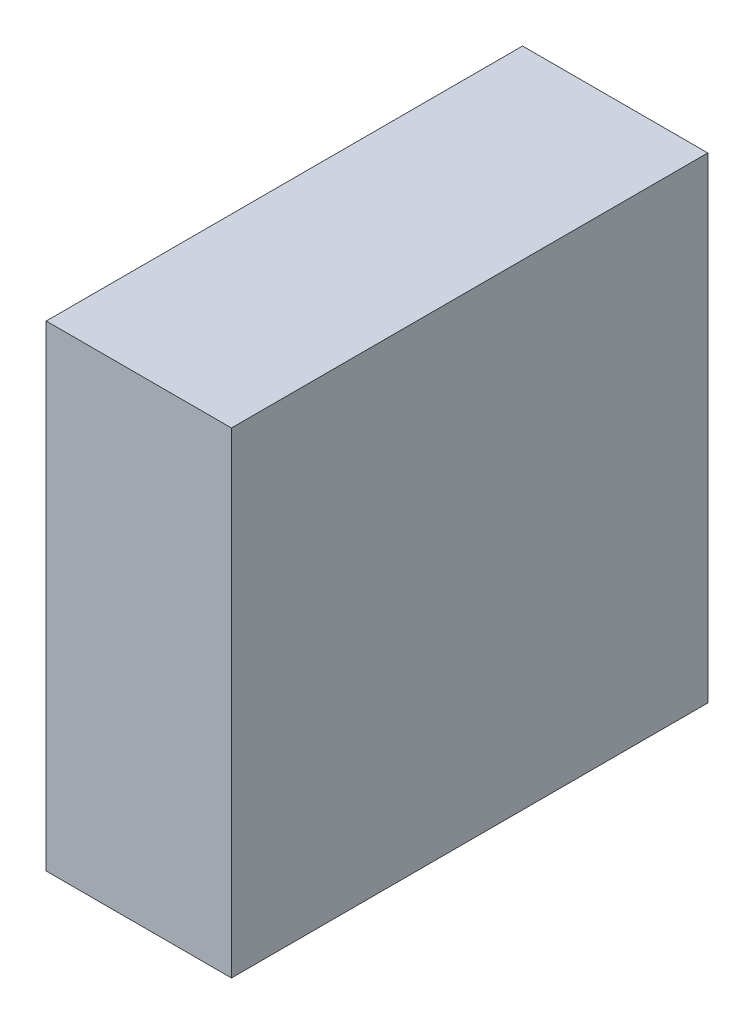
ISO-10303-21;
HEADER;
FILE_DESCRIPTION(('STEP AP214'),'2;1');
FILE_NAME('part.step','',(''),(''),'','','');
FILE_SCHEMA(('AUTOMOTIVE_DESIGN { 1 0 10303 214 1 1 1 1 }'));
ENDSEC;
DATA;
#1=APPLICATION_CONTEXT('core data for automotive mechanical design processes');
#2=APPLICATION_PROTOCOL_DEFINITION('international standard','automotive_design',2000,#1);
#3=PRODUCT_CONTEXT('',#1,'mechanical');
#4=PRODUCT('Part','Part','',(#3));
#5=PRODUCT_RELATED_PRODUCT_CATEGORY('part','',(#4));
#6=PRODUCT_DEFINITION_FORMATION('','',#4);
#7=PRODUCT_DEFINITION_CONTEXT('part definition',#1,'design');
#8=PRODUCT_DEFINITION('design','',#6,#7);
#9=PRODUCT_DEFINITION_SHAPE('','',#8);
#10=(LENGTH_UNIT() NAMED_UNIT(*) SI_UNIT(.MILLI.,.METRE.));
#11=(NAMED_UNIT(*) PLANE_ANGLE_UNIT() SI_UNIT($,.RADIAN.));
#12=(NAMED_UNIT(*) SI_UNIT($,.STERADIAN.) SOLID_ANGLE_UNIT());
#13=UNCERTAINTY_MEASURE_WITH_UNIT(LENGTH_MEASURE(1.E-05),#10,'distance_accuracy_value','');
#14=(GEOMETRIC_REPRESENTATION_CONTEXT(3) GLOBAL_UNCERTAINTY_ASSIGNED_CONTEXT((#13)) GLOBAL_UNIT_ASSIGNED_CONTEXT((#10,
#11,#12)) REPRESENTATION_CONTEXT('',''));
#15=CARTESIAN_POINT('',(0.,0.,0.));
#16=DIRECTION('',(0.,0.,1.));
#17=DIRECTION('',(1.,0.,0.));
#18=AXIS2_PLACEMENT_3D('',#15,#16,#17);
#19=CARTESIAN_POINT('',(0.17500092,-0.4499991,0.));
#20=DIRECTION('',(-1.,0.,0.));
#21=DIRECTION('',(0.,0.,1.));
#22=AXIS2_PLACEMENT_3D('',#19,#20,#21);
#23=PLANE('',#22);
#24=DIRECTION('',(0.,0.,-1.));
#25=VECTOR('',#24,1.);
#26=CARTESIAN_POINT('',(0.17500092,0.4499991,0.));
#27=LINE('',#26,#25);
#28=CARTESIAN_POINT('',(0.17500092,0.4499991,0.));
#29=VERTEX_POINT('',#28);
#30=CARTESIAN_POINT('',(0.17500092,0.4499991,0.90000074));
#31=VERTEX_POINT('',#30);
#32=EDGE_CURVE('E20',#29,#31,#27,.F.);
#33=ORIENTED_EDGE('',*,*,#32,.T.);
#34=DIRECTION('',(0.,1.,0.));
#35=VECTOR('',#34,1.);
#36=CARTESIAN_POINT('',(0.17500092,0.4499991,0.90000074));
#37=LINE('',#36,#35);
#38=CARTESIAN_POINT('',(0.17500092,-0.4499991,0.90000074));
#39=VERTEX_POINT('',#38);
#40=EDGE_CURVE('E55',#31,#39,#37,.F.);
#41=ORIENTED_EDGE('',*,*,#40,.T.);
#42=DIRECTION('',(0.,0.,1.));
#43=VECTOR('',#42,1.);
#44=CARTESIAN_POINT('',(0.17500092,-0.4499991,0.));
#45=LINE('',#44,#43);
#46=CARTESIAN_POINT('',(0.17500092,-0.4499991,0.));
#47=VERTEX_POINT('',#46);
#48=EDGE_CURVE('E76',#39,#47,#45,.F.);
#49=ORIENTED_EDGE('',*,*,#48,.T.);
#50=DIRECTION('',(0.,1.,0.));
#51=VECTOR('',#50,1.);
#52=CARTESIAN_POINT('',(0.17500092,0.4499991,0.));
#53=LINE('',#52,#51);
#54=EDGE_CURVE('E58',#29,#47,#53,.F.);
#55=ORIENTED_EDGE('',*,*,#54,.F.);
#56=EDGE_LOOP('',(#33,#41,#49,#55));
#57=FACE_BOUND('',#56,.T.);
#58=ADVANCED_FACE('F17',(#57),#23,.F.);
#59=CARTESIAN_POINT('',(0.17500092,0.4499991,0.));
#60=DIRECTION('',(0.,-1.,0.));
#61=DIRECTION('',(0.,0.,-1.));
#62=AXIS2_PLACEMENT_3D('',#59,#60,#61);
#63=PLANE('',#62);
#64=DIRECTION('',(0.,0.,-1.));
#65=VECTOR('',#64,1.);
#66=CARTESIAN_POINT('',(-0.17500092,0.4499991,0.));
#67=LINE('',#66,#65);
#68=CARTESIAN_POINT('',(-0.17500092,0.4499991,0.));
#69=VERTEX_POINT('',#68);
#70=CARTESIAN_POINT('',(-0.17500092,0.4499991,0.90000074));
#71=VERTEX_POINT('',#70);
#72=EDGE_CURVE('E73',#69,#71,#67,.F.);
#73=ORIENTED_EDGE('',*,*,#72,.T.);
#74=DIRECTION('',(-1.,0.,0.));
#75=VECTOR('',#74,1.);
#76=CARTESIAN_POINT('',(-0.17500092,0.4499991,0.90000074));
#77=LINE('',#76,#75);
#78=EDGE_CURVE('E63',#71,#31,#77,.F.);
#79=ORIENTED_EDGE('',*,*,#78,.T.);
#80=ORIENTED_EDGE('',*,*,#32,.F.);
#81=DIRECTION('',(-1.,0.,0.));
#82=VECTOR('',#81,1.);
#83=CARTESIAN_POINT('',(-0.17500092,0.4499991,0.));
#84=LINE('',#83,#82);
#85=EDGE_CURVE('E78',#69,#29,#84,.F.);
#86=ORIENTED_EDGE('',*,*,#85,.F.);
#87=EDGE_LOOP('',(#73,#79,#80,#86));
#88=FACE_BOUND('',#87,.T.);
#89=ADVANCED_FACE('F72',(#88),#63,.F.);
#90=CARTESIAN_POINT('',(-0.17500092,0.4499991,0.90000074));
#91=DIRECTION('',(0.,0.,-1.));
#92=DIRECTION('',(-1.,0.,0.));
#93=AXIS2_PLACEMENT_3D('',#90,#91,#92);
#94=PLANE('',#93);
#95=DIRECTION('',(1.,0.,0.));
#96=VECTOR('',#95,1.);
#97=CARTESIAN_POINT('',(-0.17500092,-0.4499991,0.90000074));
#98=LINE('',#97,#96);
#99=CARTESIAN_POINT('',(-0.17500092,-0.4499991,0.90000074));
#100=VERTEX_POINT('',#99);
#101=EDGE_CURVE('E69',#100,#39,#98,.T.);
#102=ORIENTED_EDGE('',*,*,#101,.T.);
#103=ORIENTED_EDGE('',*,*,#40,.F.);
#104=ORIENTED_EDGE('',*,*,#78,.F.);
#105=DIRECTION('',(0.,1.,0.));
#106=VECTOR('',#105,1.);
#107=CARTESIAN_POINT('',(-0.17500092,0.4499991,0.90000074));
#108=LINE('',#107,#106);
#109=EDGE_CURVE('E83',#71,#100,#108,.F.);
#110=ORIENTED_EDGE('',*,*,#109,.T.);
#111=EDGE_LOOP('',(#102,#103,#104,#110));
#112=FACE_BOUND('',#111,.T.);
#113=ADVANCED_FACE('F66',(#112),#94,.F.);
#114=CARTESIAN_POINT('',(-0.17500092,-0.4499991,0.));
#115=DIRECTION('',(0.,1.,0.));
#116=DIRECTION('',(0.,0.,1.));
#117=AXIS2_PLACEMENT_3D('',#114,#115,#116);
#118=PLANE('',#117);
#119=ORIENTED_EDGE('',*,*,#48,.F.);
#120=ORIENTED_EDGE('',*,*,#101,.F.);
#121=DIRECTION('',(0.,0.,-1.));
#122=VECTOR('',#121,1.);
#123=CARTESIAN_POINT('',(-0.17500092,-0.4499991,0.));
#124=LINE('',#123,#122);
#125=CARTESIAN_POINT('',(-0.17500092,-0.4499991,0.));
#126=VERTEX_POINT('',#125);
#127=EDGE_CURVE('E26',#100,#126,#124,.T.);
#128=ORIENTED_EDGE('',*,*,#127,.T.);
#129=DIRECTION('',(-1.,0.,0.));
#130=VECTOR('',#129,1.);
#131=CARTESIAN_POINT('',(-0.17500092,-0.4499991,0.));
#132=LINE('',#131,#130);
#133=EDGE_CURVE('E34',#47,#126,#132,.T.);
#134=ORIENTED_EDGE('',*,*,#133,.F.);
#135=EDGE_LOOP('',(#119,#120,#128,#134));
#136=FACE_BOUND('',#135,.T.);
#137=ADVANCED_FACE('F88',(#136),#118,.F.);
#138=CARTESIAN_POINT('',(-0.17500092,0.4499991,0.));
#139=DIRECTION('',(0.,0.,-1.));
#140=DIRECTION('',(-1.,0.,0.));
#141=AXIS2_PLACEMENT_3D('',#138,#139,#140);
#142=PLANE('',#141);
#143=ORIENTED_EDGE('',*,*,#133,.T.);
#144=DIRECTION('',(0.,1.,0.));
#145=VECTOR('',#144,1.);
#146=CARTESIAN_POINT('',(-0.17500092,0.4499991,0.));
#147=LINE('',#146,#145);
#148=EDGE_CURVE('E11',#126,#69,#147,.T.);
#149=ORIENTED_EDGE('',*,*,#148,.T.);
#150=ORIENTED_EDGE('',*,*,#85,.T.);
#151=ORIENTED_EDGE('',*,*,#54,.T.);
#152=EDGE_LOOP('',(#143,#149,#150,#151));
#153=FACE_BOUND('',#152,.T.);
#154=ADVANCED_FACE('F91',(#153),#142,.T.);
#155=CARTESIAN_POINT('',(-0.17500092,0.4499991,0.));
#156=DIRECTION('',(1.,0.,0.));
#157=DIRECTION('',(0.,0.,-1.));
#158=AXIS2_PLACEMENT_3D('',#155,#156,#157);
#159=PLANE('',#158);
#160=ORIENTED_EDGE('',*,*,#127,.F.);
#161=ORIENTED_EDGE('',*,*,#109,.F.);
#162=ORIENTED_EDGE('',*,*,#72,.F.);
#163=ORIENTED_EDGE('',*,*,#148,.F.);
#164=EDGE_LOOP('',(#160,#161,#162,#163));
#165=FACE_BOUND('',#164,.T.);
#166=ADVANCED_FACE('F90',(#165),#159,.F.);
#167=CLOSED_SHELL('',(#58,#89,#113,#137,#154,#166));
#168=MANIFOLD_SOLID_BREP('B1',#167);
#169=ADVANCED_BREP_SHAPE_REPRESENTATION('',(#18,#168),#14);
#170=SHAPE_DEFINITION_REPRESENTATION(#9,#169);
ENDSEC;
END-ISO-10303-21;
